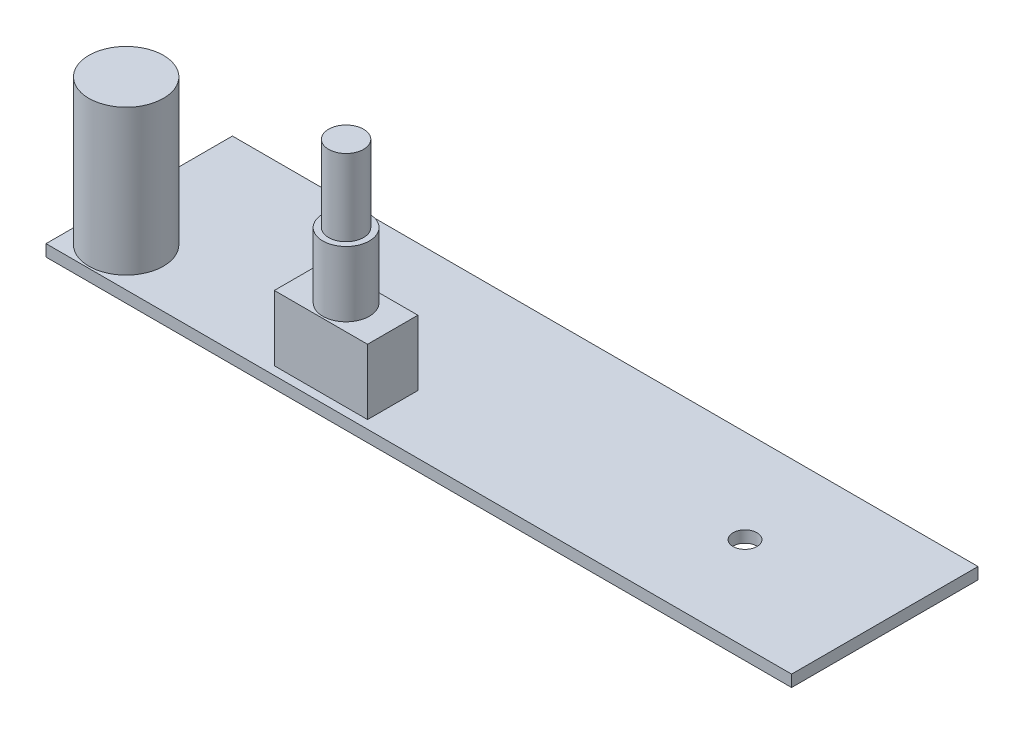
ISO-10303-21;
HEADER;
FILE_DESCRIPTION(('STEP AP214'),'2;1');
FILE_NAME('part.step','',(''),(''),'','','');
FILE_SCHEMA(('AUTOMOTIVE_DESIGN { 1 0 10303 214 1 1 1 1 }'));
ENDSEC;
DATA;
#1=APPLICATION_CONTEXT('core data for automotive mechanical design processes');
#2=APPLICATION_PROTOCOL_DEFINITION('international standard','automotive_design',2000,#1);
#3=PRODUCT_CONTEXT('',#1,'mechanical');
#4=PRODUCT('Part','Part','',(#3));
#5=PRODUCT_RELATED_PRODUCT_CATEGORY('part','',(#4));
#6=PRODUCT_DEFINITION_FORMATION('','',#4);
#7=PRODUCT_DEFINITION_CONTEXT('part definition',#1,'design');
#8=PRODUCT_DEFINITION('design','',#6,#7);
#9=PRODUCT_DEFINITION_SHAPE('','',#8);
#10=(LENGTH_UNIT() NAMED_UNIT(*) SI_UNIT(.MILLI.,.METRE.));
#11=(NAMED_UNIT(*) PLANE_ANGLE_UNIT() SI_UNIT($,.RADIAN.));
#12=(NAMED_UNIT(*) SI_UNIT($,.STERADIAN.) SOLID_ANGLE_UNIT());
#13=UNCERTAINTY_MEASURE_WITH_UNIT(LENGTH_MEASURE(1.E-05),#10,'distance_accuracy_value','');
#14=(GEOMETRIC_REPRESENTATION_CONTEXT(3) GLOBAL_UNCERTAINTY_ASSIGNED_CONTEXT((#13)) GLOBAL_UNIT_ASSIGNED_CONTEXT((#10,
#11,#12)) REPRESENTATION_CONTEXT('',''));
#15=CARTESIAN_POINT('',(0.,0.,0.));
#16=DIRECTION('',(0.,0.,1.));
#17=DIRECTION('',(1.,0.,0.));
#18=AXIS2_PLACEMENT_3D('',#15,#16,#17);
#19=CARTESIAN_POINT('',(0.,1.5875,0.));
#20=DIRECTION('',(0.,-1.,0.));
#21=DIRECTION('',(0.,0.,-1.));
#22=AXIS2_PLACEMENT_3D('',#19,#20,#21);
#23=PLANE('',#22);
#24=DIRECTION('',(0.,0.,1.));
#25=VECTOR('',#24,1.);
#26=CARTESIAN_POINT('',(0.,1.5875,0.));
#27=LINE('',#26,#25);
#28=CARTESIAN_POINT('',(0.,1.5875,-25.4));
#29=VERTEX_POINT('',#28);
#30=CARTESIAN_POINT('',(0.,1.5875,0.));
#31=VERTEX_POINT('',#30);
#32=EDGE_CURVE('E155',#29,#31,#27,.T.);
#33=ORIENTED_EDGE('',*,*,#32,.T.);
#34=DIRECTION('',(1.,0.,0.));
#35=VECTOR('',#34,1.);
#36=CARTESIAN_POINT('',(0.,1.5875,0.));
#37=LINE('',#36,#35);
#38=CARTESIAN_POINT('',(101.6,1.5875,0.));
#39=VERTEX_POINT('',#38);
#40=EDGE_CURVE('E158',#31,#39,#37,.T.);
#41=ORIENTED_EDGE('',*,*,#40,.T.);
#42=DIRECTION('',(0.,0.,-1.));
#43=VECTOR('',#42,1.);
#44=CARTESIAN_POINT('',(101.6,1.5875,0.));
#45=LINE('',#44,#43);
#46=CARTESIAN_POINT('',(101.6,1.5875,-25.4));
#47=VERTEX_POINT('',#46);
#48=EDGE_CURVE('E161',#39,#47,#45,.T.);
#49=ORIENTED_EDGE('',*,*,#48,.T.);
#50=DIRECTION('',(-1.,0.,0.));
#51=VECTOR('',#50,1.);
#52=CARTESIAN_POINT('',(0.,1.5875,-25.4));
#53=LINE('',#52,#51);
#54=EDGE_CURVE('E163',#47,#29,#53,.T.);
#55=ORIENTED_EDGE('',*,*,#54,.T.);
#56=EDGE_LOOP('',(#33,#41,#49,#55));
#57=FACE_BOUND('',#56,.T.);
#58=CARTESIAN_POINT('',(82.55,1.5875,-12.7));
#59=DIRECTION('',(0.,1.,0.));
#60=DIRECTION('',(0.,0.,1.));
#61=AXIS2_PLACEMENT_3D('',#58,#59,#60);
#62=CIRCLE('',#61,1.63194999999999);
#63=CARTESIAN_POINT('',(82.55,1.5875,-11.06805));
#64=VERTEX_POINT('',#63);
#65=EDGE_CURVE('E148',#64,#64,#62,.T.);
#66=ORIENTED_EDGE('',*,*,#65,.F.);
#67=EDGE_LOOP('',(#66));
#68=FACE_BOUND('',#67,.T.);
#69=CARTESIAN_POINT('',(31.75,1.5875,-12.7));
#70=DIRECTION('',(0.,1.,0.));
#71=DIRECTION('',(0.,0.,1.));
#72=AXIS2_PLACEMENT_3D('',#69,#70,#71);
#73=CIRCLE('',#72,1.63194999999999);
#74=CARTESIAN_POINT('',(31.75,1.5875,-11.06805));
#75=VERTEX_POINT('',#74);
#76=EDGE_CURVE('E137',#75,#75,#73,.T.);
#77=ORIENTED_EDGE('',*,*,#76,.F.);
#78=EDGE_LOOP('',(#77));
#79=FACE_BOUND('',#78,.T.);
#80=CARTESIAN_POINT('',(5.588,1.5875,-5.334));
#81=DIRECTION('',(0.,-1.,0.));
#82=DIRECTION('',(0.,0.,-1.));
#83=AXIS2_PLACEMENT_3D('',#80,#81,#82);
#84=CIRCLE('',#83,5.08);
#85=CARTESIAN_POINT('',(5.588,1.5875,-10.414));
#86=VERTEX_POINT('',#85);
#87=EDGE_CURVE('E56',#86,#86,#84,.F.);
#88=ORIENTED_EDGE('',*,*,#87,.F.);
#89=EDGE_LOOP('',(#88));
#90=FACE_BOUND('',#89,.T.);
#91=DIRECTION('',(0.,0.,1.));
#92=VECTOR('',#91,1.);
#93=CARTESIAN_POINT('',(29.972,1.5875,-8.001));
#94=LINE('',#93,#92);
#95=CARTESIAN_POINT('',(29.972,1.5875,-8.001));
#96=VERTEX_POINT('',#95);
#97=CARTESIAN_POINT('',(29.972,1.5875,-1.143));
#98=VERTEX_POINT('',#97);
#99=EDGE_CURVE('E133',#96,#98,#94,.T.);
#100=ORIENTED_EDGE('',*,*,#99,.F.);
#101=DIRECTION('',(-1.,0.,0.));
#102=VECTOR('',#101,1.);
#103=CARTESIAN_POINT('',(42.672,1.5875,-8.001));
#104=LINE('',#103,#102);
#105=CARTESIAN_POINT('',(42.672,1.5875,-8.001));
#106=VERTEX_POINT('',#105);
#107=EDGE_CURVE('E130',#106,#96,#104,.T.);
#108=ORIENTED_EDGE('',*,*,#107,.F.);
#109=DIRECTION('',(0.,0.,-1.));
#110=VECTOR('',#109,1.);
#111=CARTESIAN_POINT('',(42.672,1.5875,-8.001));
#112=LINE('',#111,#110);
#113=CARTESIAN_POINT('',(42.672,1.5875,-1.143));
#114=VERTEX_POINT('',#113);
#115=EDGE_CURVE('E68',#114,#106,#112,.T.);
#116=ORIENTED_EDGE('',*,*,#115,.F.);
#117=DIRECTION('',(1.,0.,0.));
#118=VECTOR('',#117,1.);
#119=CARTESIAN_POINT('',(42.672,1.5875,-1.143));
#120=LINE('',#119,#118);
#121=EDGE_CURVE('E63',#98,#114,#120,.T.);
#122=ORIENTED_EDGE('',*,*,#121,.F.);
#123=EDGE_LOOP('',(#100,#108,#116,#122));
#124=FACE_BOUND('',#123,.T.);
#125=ADVANCED_FACE('F48',(#57,#68,#79,#90,#124),#23,.F.);
#126=CARTESIAN_POINT('',(0.,1.5875,0.));
#127=DIRECTION('',(1.,0.,0.));
#128=DIRECTION('',(0.,0.,-1.));
#129=AXIS2_PLACEMENT_3D('',#126,#127,#128);
#130=PLANE('',#129);
#131=DIRECTION('',(0.,0.,1.));
#132=VECTOR('',#131,1.);
#133=CARTESIAN_POINT('',(0.,0.,0.));
#134=LINE('',#133,#132);
#135=CARTESIAN_POINT('',(0.,0.,-25.4));
#136=VERTEX_POINT('',#135);
#137=CARTESIAN_POINT('',(0.,0.,0.));
#138=VERTEX_POINT('',#137);
#139=EDGE_CURVE('E154',#136,#138,#134,.T.);
#140=ORIENTED_EDGE('',*,*,#139,.T.);
#141=DIRECTION('',(0.,-1.,0.));
#142=VECTOR('',#141,1.);
#143=CARTESIAN_POINT('',(0.,1.5875,0.));
#144=LINE('',#143,#142);
#145=EDGE_CURVE('E181',#31,#138,#144,.T.);
#146=ORIENTED_EDGE('',*,*,#145,.F.);
#147=ORIENTED_EDGE('',*,*,#32,.F.);
#148=DIRECTION('',(0.,-1.,0.));
#149=VECTOR('',#148,1.);
#150=CARTESIAN_POINT('',(0.,1.5875,-25.4));
#151=LINE('',#150,#149);
#152=EDGE_CURVE('E165',#29,#136,#151,.T.);
#153=ORIENTED_EDGE('',*,*,#152,.T.);
#154=EDGE_LOOP('',(#140,#146,#147,#153));
#155=FACE_BOUND('',#154,.T.);
#156=ADVANCED_FACE('F50',(#155),#130,.F.);
#157=CARTESIAN_POINT('',(0.,1.5875,0.));
#158=DIRECTION('',(0.,0.,-1.));
#159=DIRECTION('',(-1.,0.,0.));
#160=AXIS2_PLACEMENT_3D('',#157,#158,#159);
#161=PLANE('',#160);
#162=DIRECTION('',(1.,0.,0.));
#163=VECTOR('',#162,1.);
#164=CARTESIAN_POINT('',(0.,0.,0.));
#165=LINE('',#164,#163);
#166=CARTESIAN_POINT('',(101.6,0.,0.));
#167=VERTEX_POINT('',#166);
#168=EDGE_CURVE('E168',#138,#167,#165,.T.);
#169=ORIENTED_EDGE('',*,*,#168,.T.);
#170=DIRECTION('',(0.,-1.,0.));
#171=VECTOR('',#170,1.);
#172=CARTESIAN_POINT('',(101.6,1.5875,0.));
#173=LINE('',#172,#171);
#174=EDGE_CURVE('E178',#39,#167,#173,.T.);
#175=ORIENTED_EDGE('',*,*,#174,.F.);
#176=ORIENTED_EDGE('',*,*,#40,.F.);
#177=ORIENTED_EDGE('',*,*,#145,.T.);
#178=EDGE_LOOP('',(#169,#175,#176,#177));
#179=FACE_BOUND('',#178,.T.);
#180=ADVANCED_FACE('F275',(#179),#161,.F.);
#181=CARTESIAN_POINT('',(101.6,1.5875,0.));
#182=DIRECTION('',(-1.,0.,0.));
#183=DIRECTION('',(0.,0.,1.));
#184=AXIS2_PLACEMENT_3D('',#181,#182,#183);
#185=PLANE('',#184);
#186=DIRECTION('',(0.,0.,-1.));
#187=VECTOR('',#186,1.);
#188=CARTESIAN_POINT('',(101.6,0.,0.));
#189=LINE('',#188,#187);
#190=CARTESIAN_POINT('',(101.6,0.,-25.4));
#191=VERTEX_POINT('',#190);
#192=EDGE_CURVE('E170',#167,#191,#189,.T.);
#193=ORIENTED_EDGE('',*,*,#192,.T.);
#194=DIRECTION('',(0.,-1.,0.));
#195=VECTOR('',#194,1.);
#196=CARTESIAN_POINT('',(101.6,1.5875,-25.4));
#197=LINE('',#196,#195);
#198=EDGE_CURVE('E175',#47,#191,#197,.T.);
#199=ORIENTED_EDGE('',*,*,#198,.F.);
#200=ORIENTED_EDGE('',*,*,#48,.F.);
#201=ORIENTED_EDGE('',*,*,#174,.T.);
#202=EDGE_LOOP('',(#193,#199,#200,#201));
#203=FACE_BOUND('',#202,.T.);
#204=ADVANCED_FACE('F272',(#203),#185,.F.);
#205=CARTESIAN_POINT('',(0.,1.5875,-25.4));
#206=DIRECTION('',(0.,0.,1.));
#207=DIRECTION('',(1.,0.,0.));
#208=AXIS2_PLACEMENT_3D('',#205,#206,#207);
#209=PLANE('',#208);
#210=DIRECTION('',(-1.,0.,0.));
#211=VECTOR('',#210,1.);
#212=CARTESIAN_POINT('',(0.,0.,-25.4));
#213=LINE('',#212,#211);
#214=EDGE_CURVE('E159',#191,#136,#213,.T.);
#215=ORIENTED_EDGE('',*,*,#214,.T.);
#216=ORIENTED_EDGE('',*,*,#152,.F.);
#217=ORIENTED_EDGE('',*,*,#54,.F.);
#218=ORIENTED_EDGE('',*,*,#198,.T.);
#219=EDGE_LOOP('',(#215,#216,#217,#218));
#220=FACE_BOUND('',#219,.T.);
#221=ADVANCED_FACE('F268',(#220),#209,.F.);
#222=CARTESIAN_POINT('',(0.,0.,0.));
#223=DIRECTION('',(0.,-1.,0.));
#224=DIRECTION('',(0.,0.,-1.));
#225=AXIS2_PLACEMENT_3D('',#222,#223,#224);
#226=PLANE('',#225);
#227=CARTESIAN_POINT('',(31.75,0.,-12.7));
#228=DIRECTION('',(0.,-1.,0.));
#229=DIRECTION('',(0.,0.,-1.));
#230=AXIS2_PLACEMENT_3D('',#227,#228,#229);
#231=CIRCLE('',#230,1.63194999999999);
#232=CARTESIAN_POINT('',(31.75,0.,-14.33195));
#233=VERTEX_POINT('',#232);
#234=EDGE_CURVE('E145',#233,#233,#231,.T.);
#235=ORIENTED_EDGE('',*,*,#234,.F.);
#236=EDGE_LOOP('',(#235));
#237=FACE_BOUND('',#236,.T.);
#238=CARTESIAN_POINT('',(82.55,0.,-12.7));
#239=DIRECTION('',(0.,-1.,0.));
#240=DIRECTION('',(0.,0.,-1.));
#241=AXIS2_PLACEMENT_3D('',#238,#239,#240);
#242=CIRCLE('',#241,1.63194999999999);
#243=CARTESIAN_POINT('',(82.55,0.,-14.33195));
#244=VERTEX_POINT('',#243);
#245=EDGE_CURVE('E151',#244,#244,#242,.T.);
#246=ORIENTED_EDGE('',*,*,#245,.F.);
#247=EDGE_LOOP('',(#246));
#248=FACE_BOUND('',#247,.T.);
#249=ORIENTED_EDGE('',*,*,#139,.F.);
#250=ORIENTED_EDGE('',*,*,#214,.F.);
#251=ORIENTED_EDGE('',*,*,#192,.F.);
#252=ORIENTED_EDGE('',*,*,#168,.F.);
#253=EDGE_LOOP('',(#249,#250,#251,#252));
#254=FACE_BOUND('',#253,.T.);
#255=ADVANCED_FACE('F263',(#237,#248,#254),#226,.T.);
#256=CARTESIAN_POINT('',(82.55,1.5875,-12.7));
#257=DIRECTION('',(0.,1.,0.));
#258=DIRECTION('',(0.,0.,1.));
#259=AXIS2_PLACEMENT_3D('',#256,#257,#258);
#260=CYLINDRICAL_SURFACE('',#259,1.63194999999999);
#261=ORIENTED_EDGE('',*,*,#65,.T.);
#262=EDGE_LOOP('',(#261));
#263=FACE_BOUND('',#262,.T.);
#264=ORIENTED_EDGE('',*,*,#245,.T.);
#265=EDGE_LOOP('',(#264));
#266=FACE_BOUND('',#265,.T.);
#267=ADVANCED_FACE('F260',(#263,#266),#260,.F.);
#268=CARTESIAN_POINT('',(31.75,1.5875,-12.7));
#269=DIRECTION('',(0.,1.,0.));
#270=DIRECTION('',(0.,0.,1.));
#271=AXIS2_PLACEMENT_3D('',#268,#269,#270);
#272=CYLINDRICAL_SURFACE('',#271,1.63194999999999);
#273=ORIENTED_EDGE('',*,*,#76,.T.);
#274=EDGE_LOOP('',(#273));
#275=FACE_BOUND('',#274,.T.);
#276=ORIENTED_EDGE('',*,*,#234,.T.);
#277=EDGE_LOOP('',(#276));
#278=FACE_BOUND('',#277,.T.);
#279=ADVANCED_FACE('F256',(#275,#278),#272,.F.);
#280=CARTESIAN_POINT('',(5.588,21.3995,-5.334));
#281=DIRECTION('',(0.,-1.,0.));
#282=DIRECTION('',(0.,0.,-1.));
#283=AXIS2_PLACEMENT_3D('',#280,#281,#282);
#284=CYLINDRICAL_SURFACE('',#283,5.08);
#285=CARTESIAN_POINT('',(5.588,21.3995,-5.334));
#286=DIRECTION('',(0.,1.,0.));
#287=DIRECTION('',(0.,0.,1.));
#288=AXIS2_PLACEMENT_3D('',#285,#286,#287);
#289=CIRCLE('',#288,5.08);
#290=CARTESIAN_POINT('',(5.588,21.3995,-0.253999999999997));
#291=VERTEX_POINT('',#290);
#292=EDGE_CURVE('E134',#291,#291,#289,.T.);
#293=ORIENTED_EDGE('',*,*,#292,.F.);
#294=EDGE_LOOP('',(#293));
#295=FACE_BOUND('',#294,.T.);
#296=ORIENTED_EDGE('',*,*,#87,.T.);
#297=EDGE_LOOP('',(#296));
#298=FACE_BOUND('',#297,.T.);
#299=ADVANCED_FACE('F186',(#295,#298),#284,.T.);
#300=CARTESIAN_POINT('',(5.588,21.3995,-5.334));
#301=DIRECTION('',(0.,1.,0.));
#302=DIRECTION('',(0.,0.,1.));
#303=AXIS2_PLACEMENT_3D('',#300,#301,#302);
#304=PLANE('',#303);
#305=ORIENTED_EDGE('',*,*,#292,.T.);
#306=EDGE_LOOP('',(#305));
#307=FACE_BOUND('',#306,.T.);
#308=ADVANCED_FACE('F250',(#307),#304,.T.);
#309=CARTESIAN_POINT('',(29.972,10.4775,-8.001));
#310=DIRECTION('',(1.,0.,0.));
#311=DIRECTION('',(0.,0.,-1.));
#312=AXIS2_PLACEMENT_3D('',#309,#310,#311);
#313=PLANE('',#312);
#314=ORIENTED_EDGE('',*,*,#99,.T.);
#315=DIRECTION('',(0.,-1.,0.));
#316=VECTOR('',#315,1.);
#317=CARTESIAN_POINT('',(29.972,10.4775,-1.143));
#318=LINE('',#317,#316);
#319=CARTESIAN_POINT('',(29.972,10.4775,-1.143));
#320=VERTEX_POINT('',#319);
#321=EDGE_CURVE('E114',#320,#98,#318,.T.);
#322=ORIENTED_EDGE('',*,*,#321,.F.);
#323=DIRECTION('',(0.,0.,1.));
#324=VECTOR('',#323,1.);
#325=CARTESIAN_POINT('',(29.972,10.4775,-8.001));
#326=LINE('',#325,#324);
#327=CARTESIAN_POINT('',(29.972,10.4775,-8.001));
#328=VERTEX_POINT('',#327);
#329=EDGE_CURVE('E121',#328,#320,#326,.T.);
#330=ORIENTED_EDGE('',*,*,#329,.F.);
#331=DIRECTION('',(0.,-1.,0.));
#332=VECTOR('',#331,1.);
#333=CARTESIAN_POINT('',(29.972,10.4775,-8.001));
#334=LINE('',#333,#332);
#335=EDGE_CURVE('E197',#328,#96,#334,.T.);
#336=ORIENTED_EDGE('',*,*,#335,.T.);
#337=EDGE_LOOP('',(#314,#322,#330,#336));
#338=FACE_BOUND('',#337,.T.);
#339=ADVANCED_FACE('F132',(#338),#313,.F.);
#340=CARTESIAN_POINT('',(42.672,10.4775,-1.143));
#341=DIRECTION('',(0.,0.,-1.));
#342=DIRECTION('',(-1.,0.,0.));
#343=AXIS2_PLACEMENT_3D('',#340,#341,#342);
#344=PLANE('',#343);
#345=ORIENTED_EDGE('',*,*,#121,.T.);
#346=DIRECTION('',(0.,-1.,0.));
#347=VECTOR('',#346,1.);
#348=CARTESIAN_POINT('',(42.672,10.4775,-1.143));
#349=LINE('',#348,#347);
#350=CARTESIAN_POINT('',(42.672,10.4775,-1.143));
#351=VERTEX_POINT('',#350);
#352=EDGE_CURVE('E117',#351,#114,#349,.T.);
#353=ORIENTED_EDGE('',*,*,#352,.F.);
#354=DIRECTION('',(1.,0.,0.));
#355=VECTOR('',#354,1.);
#356=CARTESIAN_POINT('',(42.672,10.4775,-1.143));
#357=LINE('',#356,#355);
#358=EDGE_CURVE('E110',#320,#351,#357,.T.);
#359=ORIENTED_EDGE('',*,*,#358,.F.);
#360=ORIENTED_EDGE('',*,*,#321,.T.);
#361=EDGE_LOOP('',(#345,#353,#359,#360));
#362=FACE_BOUND('',#361,.T.);
#363=ADVANCED_FACE('F112',(#362),#344,.F.);
#364=CARTESIAN_POINT('',(42.672,10.4775,-8.001));
#365=DIRECTION('',(-1.,0.,0.));
#366=DIRECTION('',(0.,0.,1.));
#367=AXIS2_PLACEMENT_3D('',#364,#365,#366);
#368=PLANE('',#367);
#369=ORIENTED_EDGE('',*,*,#115,.T.);
#370=DIRECTION('',(0.,-1.,0.));
#371=VECTOR('',#370,1.);
#372=CARTESIAN_POINT('',(42.672,10.4775,-8.001));
#373=LINE('',#372,#371);
#374=CARTESIAN_POINT('',(42.672,10.4775,-8.001));
#375=VERTEX_POINT('',#374);
#376=EDGE_CURVE('E139',#375,#106,#373,.T.);
#377=ORIENTED_EDGE('',*,*,#376,.F.);
#378=DIRECTION('',(0.,0.,-1.));
#379=VECTOR('',#378,1.);
#380=CARTESIAN_POINT('',(42.672,10.4775,-8.001));
#381=LINE('',#380,#379);
#382=EDGE_CURVE('E120',#351,#375,#381,.T.);
#383=ORIENTED_EDGE('',*,*,#382,.F.);
#384=ORIENTED_EDGE('',*,*,#352,.T.);
#385=EDGE_LOOP('',(#369,#377,#383,#384));
#386=FACE_BOUND('',#385,.T.);
#387=ADVANCED_FACE('F240',(#386),#368,.F.);
#388=CARTESIAN_POINT('',(42.672,10.4775,-8.001));
#389=DIRECTION('',(0.,0.,1.));
#390=DIRECTION('',(1.,0.,0.));
#391=AXIS2_PLACEMENT_3D('',#388,#389,#390);
#392=PLANE('',#391);
#393=ORIENTED_EDGE('',*,*,#107,.T.);
#394=ORIENTED_EDGE('',*,*,#335,.F.);
#395=DIRECTION('',(-1.,0.,0.));
#396=VECTOR('',#395,1.);
#397=CARTESIAN_POINT('',(42.672,10.4775,-8.001));
#398=LINE('',#397,#396);
#399=EDGE_CURVE('E126',#375,#328,#398,.T.);
#400=ORIENTED_EDGE('',*,*,#399,.F.);
#401=ORIENTED_EDGE('',*,*,#376,.T.);
#402=EDGE_LOOP('',(#393,#394,#400,#401));
#403=FACE_BOUND('',#402,.T.);
#404=ADVANCED_FACE('F196',(#403),#392,.F.);
#405=CARTESIAN_POINT('',(0.,10.4775,0.));
#406=DIRECTION('',(0.,-1.,0.));
#407=DIRECTION('',(0.,0.,-1.));
#408=AXIS2_PLACEMENT_3D('',#405,#406,#407);
#409=PLANE('',#408);
#410=CARTESIAN_POINT('',(36.322,10.4775,-4.572));
#411=DIRECTION('',(0.,-1.,0.));
#412=DIRECTION('',(0.,0.,-1.));
#413=AXIS2_PLACEMENT_3D('',#410,#411,#412);
#414=CIRCLE('',#413,3.175);
#415=CARTESIAN_POINT('',(36.322,10.4775,-7.747));
#416=VERTEX_POINT('',#415);
#417=EDGE_CURVE('E13',#416,#416,#414,.F.);
#418=ORIENTED_EDGE('',*,*,#417,.F.);
#419=EDGE_LOOP('',(#418));
#420=FACE_BOUND('',#419,.T.);
#421=ORIENTED_EDGE('',*,*,#329,.T.);
#422=ORIENTED_EDGE('',*,*,#358,.T.);
#423=ORIENTED_EDGE('',*,*,#382,.T.);
#424=ORIENTED_EDGE('',*,*,#399,.T.);
#425=EDGE_LOOP('',(#421,#422,#423,#424));
#426=FACE_BOUND('',#425,.T.);
#427=ADVANCED_FACE('F124',(#420,#426),#409,.F.);
#428=CARTESIAN_POINT('',(36.322,19.3675,-4.572));
#429=DIRECTION('',(0.,-1.,0.));
#430=DIRECTION('',(0.,0.,-1.));
#431=AXIS2_PLACEMENT_3D('',#428,#429,#430);
#432=CYLINDRICAL_SURFACE('',#431,3.175);
#433=CARTESIAN_POINT('',(36.322,19.3675,-4.572));
#434=DIRECTION('',(0.,1.,0.));
#435=DIRECTION('',(0.,0.,1.));
#436=AXIS2_PLACEMENT_3D('',#433,#434,#435);
#437=CIRCLE('',#436,3.175);
#438=CARTESIAN_POINT('',(36.322,19.3675,-1.397));
#439=VERTEX_POINT('',#438);
#440=EDGE_CURVE('E192',#439,#439,#437,.T.);
#441=ORIENTED_EDGE('',*,*,#440,.F.);
#442=EDGE_LOOP('',(#441));
#443=FACE_BOUND('',#442,.T.);
#444=ORIENTED_EDGE('',*,*,#417,.T.);
#445=EDGE_LOOP('',(#444));
#446=FACE_BOUND('',#445,.T.);
#447=ADVANCED_FACE('F226',(#443,#446),#432,.T.);
#448=CARTESIAN_POINT('',(0.,19.3675,0.));
#449=DIRECTION('',(0.,1.,0.));
#450=DIRECTION('',(0.,0.,1.));
#451=AXIS2_PLACEMENT_3D('',#448,#449,#450);
#452=PLANE('',#451);
#453=CARTESIAN_POINT('',(36.322,19.3675,-4.572));
#454=DIRECTION('',(0.,1.,0.));
#455=DIRECTION('',(0.,0.,1.));
#456=AXIS2_PLACEMENT_3D('',#453,#454,#455);
#457=CIRCLE('',#456,2.38125);
#458=CARTESIAN_POINT('',(36.322,19.3675,-2.19075));
#459=VERTEX_POINT('',#458);
#460=EDGE_CURVE('E209',#459,#459,#457,.T.);
#461=ORIENTED_EDGE('',*,*,#460,.F.);
#462=EDGE_LOOP('',(#461));
#463=FACE_BOUND('',#462,.T.);
#464=ORIENTED_EDGE('',*,*,#440,.T.);
#465=EDGE_LOOP('',(#464));
#466=FACE_BOUND('',#465,.T.);
#467=ADVANCED_FACE('F220',(#463,#466),#452,.T.);
#468=CARTESIAN_POINT('',(36.322,29.7815,-4.572));
#469=DIRECTION('',(0.,-1.,0.));
#470=DIRECTION('',(0.,0.,-1.));
#471=AXIS2_PLACEMENT_3D('',#468,#469,#470);
#472=CYLINDRICAL_SURFACE('',#471,2.38125);
#473=CARTESIAN_POINT('',(36.322,29.7815,-4.572));
#474=DIRECTION('',(0.,1.,0.));
#475=DIRECTION('',(0.,0.,1.));
#476=AXIS2_PLACEMENT_3D('',#473,#474,#475);
#477=CIRCLE('',#476,2.38125);
#478=CARTESIAN_POINT('',(36.322,29.7815,-2.19075));
#479=VERTEX_POINT('',#478);
#480=EDGE_CURVE('E208',#479,#479,#477,.T.);
#481=ORIENTED_EDGE('',*,*,#480,.F.);
#482=EDGE_LOOP('',(#481));
#483=FACE_BOUND('',#482,.T.);
#484=ORIENTED_EDGE('',*,*,#460,.T.);
#485=EDGE_LOOP('',(#484));
#486=FACE_BOUND('',#485,.T.);
#487=ADVANCED_FACE('F217',(#483,#486),#472,.T.);
#488=CARTESIAN_POINT('',(36.322,29.7815,-4.572));
#489=DIRECTION('',(0.,1.,0.));
#490=DIRECTION('',(0.,0.,1.));
#491=AXIS2_PLACEMENT_3D('',#488,#489,#490);
#492=PLANE('',#491);
#493=ORIENTED_EDGE('',*,*,#480,.T.);
#494=EDGE_LOOP('',(#493));
#495=FACE_BOUND('',#494,.T.);
#496=ADVANCED_FACE('F215',(#495),#492,.T.);
#497=CLOSED_SHELL('',(#125,#156,#180,#204,#221,#255,#267,#279,#299,#308,#339,#363,#387,#404,
#427,#447,#467,#487,#496));
#498=MANIFOLD_SOLID_BREP('B2',#497);
#499=ADVANCED_BREP_SHAPE_REPRESENTATION('',(#18,#498),#14);
#500=SHAPE_DEFINITION_REPRESENTATION(#9,#499);
ENDSEC;
END-ISO-10303-21;
